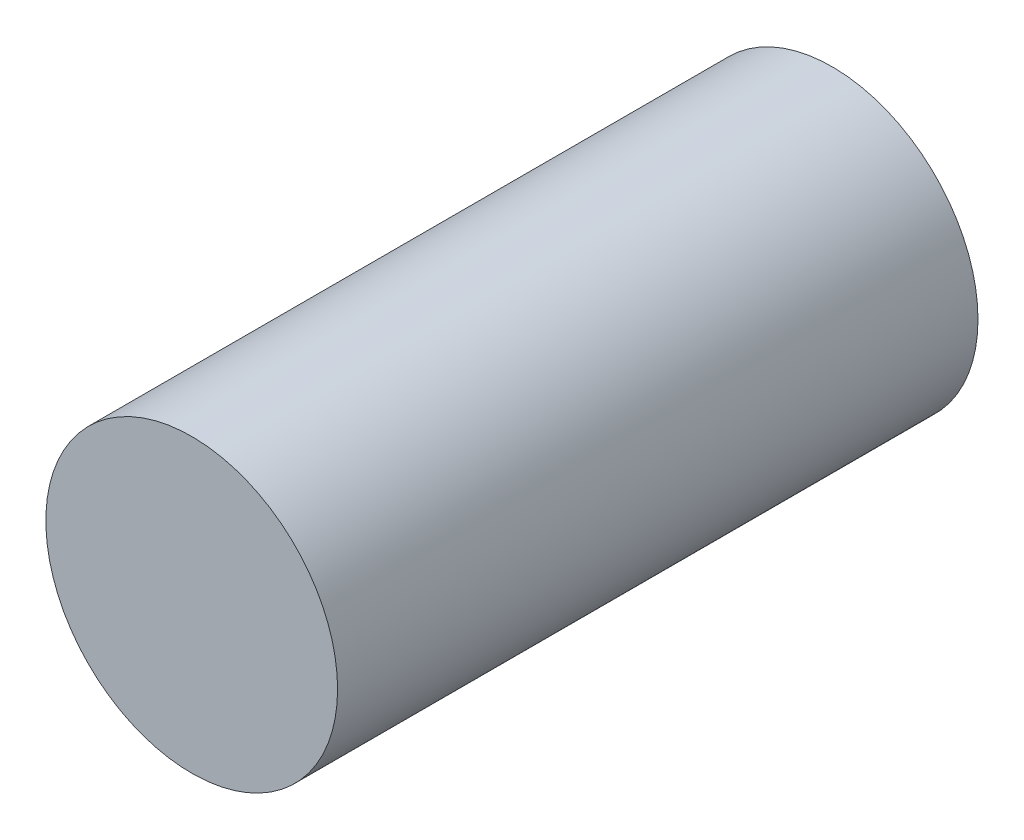
ISO-10303-21;
HEADER;
FILE_DESCRIPTION(('STEP AP214'),'2;1');
FILE_NAME('part.step','',(''),(''),'','','');
FILE_SCHEMA(('AUTOMOTIVE_DESIGN { 1 0 10303 214 1 1 1 1 }'));
ENDSEC;
DATA;
#1=APPLICATION_CONTEXT('core data for automotive mechanical design processes');
#2=APPLICATION_PROTOCOL_DEFINITION('international standard','automotive_design',2000,#1);
#3=PRODUCT_CONTEXT('',#1,'mechanical');
#4=PRODUCT('Part','Part','',(#3));
#5=PRODUCT_RELATED_PRODUCT_CATEGORY('part','',(#4));
#6=PRODUCT_DEFINITION_FORMATION('','',#4);
#7=PRODUCT_DEFINITION_CONTEXT('part definition',#1,'design');
#8=PRODUCT_DEFINITION('design','',#6,#7);
#9=PRODUCT_DEFINITION_SHAPE('','',#8);
#10=(LENGTH_UNIT() NAMED_UNIT(*) SI_UNIT(.MILLI.,.METRE.));
#11=(NAMED_UNIT(*) PLANE_ANGLE_UNIT() SI_UNIT($,.RADIAN.));
#12=(NAMED_UNIT(*) SI_UNIT($,.STERADIAN.) SOLID_ANGLE_UNIT());
#13=UNCERTAINTY_MEASURE_WITH_UNIT(LENGTH_MEASURE(1.E-05),#10,'distance_accuracy_value','');
#14=(GEOMETRIC_REPRESENTATION_CONTEXT(3) GLOBAL_UNCERTAINTY_ASSIGNED_CONTEXT((#13)) GLOBAL_UNIT_ASSIGNED_CONTEXT((#10,
#11,#12)) REPRESENTATION_CONTEXT('',''));
#15=CARTESIAN_POINT('',(0.,0.,0.));
#16=DIRECTION('',(0.,0.,1.));
#17=DIRECTION('',(1.,0.,0.));
#18=AXIS2_PLACEMENT_3D('',#15,#16,#17);
#19=CARTESIAN_POINT('',(7.62,-1.27,0.1));
#20=DIRECTION('',(0.,0.,1.));
#21=DIRECTION('',(1.,0.,0.));
#22=AXIS2_PLACEMENT_3D('',#19,#20,#21);
#23=PLANE('',#22);
#24=CARTESIAN_POINT('',(7.62,-1.27,0.1));
#25=DIRECTION('',(0.,0.,1.));
#26=DIRECTION('',(1.,0.,0.));
#27=AXIS2_PLACEMENT_3D('',#24,#25,#26);
#28=CIRCLE('',#27,0.41);
#29=CARTESIAN_POINT('',(8.03,-1.27,0.1));
#30=VERTEX_POINT('',#29);
#31=EDGE_CURVE('E17',#30,#30,#28,.F.);
#32=ORIENTED_EDGE('',*,*,#31,.F.);
#33=EDGE_LOOP('',(#32));
#34=FACE_BOUND('',#33,.T.);
#35=ADVANCED_FACE('F14',(#34),#23,.T.);
#36=CARTESIAN_POINT('',(7.62,-1.27,-1.7));
#37=DIRECTION('',(0.,0.,1.));
#38=DIRECTION('',(1.,0.,0.));
#39=AXIS2_PLACEMENT_3D('',#36,#37,#38);
#40=PLANE('',#39);
#41=CARTESIAN_POINT('',(7.62,-1.27,-1.7));
#42=DIRECTION('',(0.,0.,1.));
#43=DIRECTION('',(1.,0.,0.));
#44=AXIS2_PLACEMENT_3D('',#41,#42,#43);
#45=CIRCLE('',#44,0.41);
#46=CARTESIAN_POINT('',(8.03,-1.27,-1.7));
#47=VERTEX_POINT('',#46);
#48=EDGE_CURVE('E10',#47,#47,#45,.T.);
#49=ORIENTED_EDGE('',*,*,#48,.F.);
#50=EDGE_LOOP('',(#49));
#51=FACE_BOUND('',#50,.T.);
#52=ADVANCED_FACE('F29',(#51),#40,.F.);
#53=CARTESIAN_POINT('',(7.62,-1.27,-1.7));
#54=DIRECTION('',(0.,0.,1.));
#55=DIRECTION('',(1.,0.,0.));
#56=AXIS2_PLACEMENT_3D('',#53,#54,#55);
#57=CYLINDRICAL_SURFACE('',#56,0.41);
#58=ORIENTED_EDGE('',*,*,#48,.T.);
#59=EDGE_LOOP('',(#58));
#60=FACE_BOUND('',#59,.T.);
#61=ORIENTED_EDGE('',*,*,#31,.T.);
#62=EDGE_LOOP('',(#61));
#63=FACE_BOUND('',#62,.T.);
#64=ADVANCED_FACE('F26',(#60,#63),#57,.T.);
#65=CLOSED_SHELL('',(#35,#52,#64));
#66=MANIFOLD_SOLID_BREP('B1',#65);
#67=ADVANCED_BREP_SHAPE_REPRESENTATION('',(#18,#66),#14);
#68=SHAPE_DEFINITION_REPRESENTATION(#9,#67);
ENDSEC;
END-ISO-10303-21;
